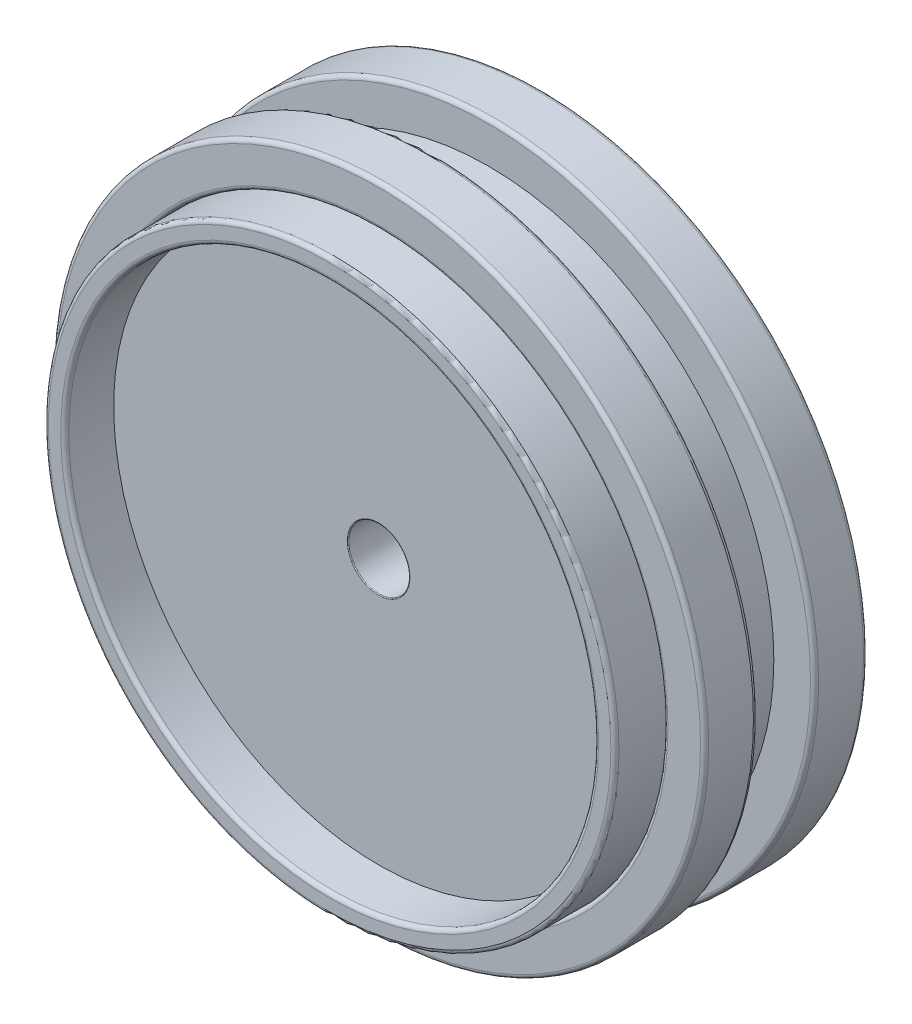
ISO-10303-21;
HEADER;
FILE_DESCRIPTION(('STEP AP214'),'2;1');
FILE_NAME('part.step','',(''),(''),'','','');
FILE_SCHEMA(('AUTOMOTIVE_DESIGN { 1 0 10303 214 1 1 1 1 }'));
ENDSEC;
DATA;
#1=APPLICATION_CONTEXT('core data for automotive mechanical design processes');
#2=APPLICATION_PROTOCOL_DEFINITION('international standard','automotive_design',2000,#1);
#3=PRODUCT_CONTEXT('',#1,'mechanical');
#4=PRODUCT('Part','Part','',(#3));
#5=PRODUCT_RELATED_PRODUCT_CATEGORY('part','',(#4));
#6=PRODUCT_DEFINITION_FORMATION('','',#4);
#7=PRODUCT_DEFINITION_CONTEXT('part definition',#1,'design');
#8=PRODUCT_DEFINITION('design','',#6,#7);
#9=PRODUCT_DEFINITION_SHAPE('','',#8);
#10=(LENGTH_UNIT() NAMED_UNIT(*) SI_UNIT(.MILLI.,.METRE.));
#11=(NAMED_UNIT(*) PLANE_ANGLE_UNIT() SI_UNIT($,.RADIAN.));
#12=(NAMED_UNIT(*) SI_UNIT($,.STERADIAN.) SOLID_ANGLE_UNIT());
#13=UNCERTAINTY_MEASURE_WITH_UNIT(LENGTH_MEASURE(1.E-05),#10,'distance_accuracy_value','');
#14=(GEOMETRIC_REPRESENTATION_CONTEXT(3) GLOBAL_UNCERTAINTY_ASSIGNED_CONTEXT((#13)) GLOBAL_UNIT_ASSIGNED_CONTEXT((#10,
#11,#12)) REPRESENTATION_CONTEXT('',''));
#15=CARTESIAN_POINT('',(0.,0.,0.));
#16=DIRECTION('',(0.,0.,1.));
#17=DIRECTION('',(1.,0.,0.));
#18=AXIS2_PLACEMENT_3D('',#15,#16,#17);
#19=CARTESIAN_POINT('',(0.,0.,-50.8));
#20=DIRECTION('',(0.,0.,1.));
#21=DIRECTION('',(1.,0.,0.));
#22=AXIS2_PLACEMENT_3D('',#19,#20,#21);
#23=CYLINDRICAL_SURFACE('',#22,88.9);
#24=CARTESIAN_POINT('',(0.,0.,-50.8));
#25=DIRECTION('',(0.,0.,1.));
#26=DIRECTION('',(1.,0.,0.));
#27=AXIS2_PLACEMENT_3D('',#24,#25,#26);
#28=CIRCLE('',#27,88.9);
#29=CARTESIAN_POINT('',(88.9,0.,-50.8));
#30=VERTEX_POINT('',#29);
#31=EDGE_CURVE('E71',#30,#30,#28,.T.);
#32=ORIENTED_EDGE('',*,*,#31,.F.);
#33=EDGE_LOOP('',(#32));
#34=FACE_BOUND('',#33,.T.);
#35=CARTESIAN_POINT('',(0.,0.,-34.29));
#36=DIRECTION('',(0.,0.,-1.));
#37=DIRECTION('',(-1.,0.,0.));
#38=AXIS2_PLACEMENT_3D('',#35,#36,#37);
#39=CIRCLE('',#38,88.9);
#40=CARTESIAN_POINT('',(-88.9,0.,-34.29));
#41=VERTEX_POINT('',#40);
#42=EDGE_CURVE('E68',#41,#41,#39,.T.);
#43=ORIENTED_EDGE('',*,*,#42,.F.);
#44=EDGE_LOOP('',(#43));
#45=FACE_BOUND('',#44,.T.);
#46=ADVANCED_FACE('F48',(#34,#45),#23,.F.);
#47=CARTESIAN_POINT('',(0.,0.,-50.8));
#48=DIRECTION('',(0.,0.,1.));
#49=DIRECTION('',(1.,0.,0.));
#50=AXIS2_PLACEMENT_3D('',#47,#48,#49);
#51=CYLINDRICAL_SURFACE('',#50,101.6);
#52=CARTESIAN_POINT('',(0.,0.,-49.53));
#53=DIRECTION('',(0.,0.,1.));
#54=DIRECTION('',(1.,0.,0.));
#55=AXIS2_PLACEMENT_3D('',#52,#53,#54);
#56=CIRCLE('',#55,101.6);
#57=CARTESIAN_POINT('',(101.6,0.,-49.53));
#58=VERTEX_POINT('',#57);
#59=EDGE_CURVE('E59',#58,#58,#56,.T.);
#60=ORIENTED_EDGE('',*,*,#59,.T.);
#61=EDGE_LOOP('',(#60));
#62=FACE_BOUND('',#61,.T.);
#63=CARTESIAN_POINT('',(0.,0.,-35.56));
#64=DIRECTION('',(0.,0.,1.));
#65=DIRECTION('',(1.,0.,0.));
#66=AXIS2_PLACEMENT_3D('',#63,#64,#65);
#67=CIRCLE('',#66,101.6);
#68=CARTESIAN_POINT('',(101.6,0.,-35.56));
#69=VERTEX_POINT('',#68);
#70=EDGE_CURVE('E63',#69,#69,#67,.F.);
#71=ORIENTED_EDGE('',*,*,#70,.T.);
#72=EDGE_LOOP('',(#71));
#73=FACE_BOUND('',#72,.T.);
#74=ADVANCED_FACE('F79',(#62,#73),#51,.T.);
#75=CARTESIAN_POINT('',(0.,0.,-50.8));
#76=DIRECTION('',(0.,0.,1.));
#77=DIRECTION('',(1.,0.,0.));
#78=AXIS2_PLACEMENT_3D('',#75,#76,#77);
#79=PLANE('',#78);
#80=CARTESIAN_POINT('',(0.,0.,-50.8));
#81=DIRECTION('',(0.,0.,1.));
#82=DIRECTION('',(1.,0.,0.));
#83=AXIS2_PLACEMENT_3D('',#80,#81,#82);
#84=CIRCLE('',#83,100.33);
#85=CARTESIAN_POINT('',(100.33,0.,-50.8));
#86=VERTEX_POINT('',#85);
#87=EDGE_CURVE('E55',#86,#86,#84,.F.);
#88=ORIENTED_EDGE('',*,*,#87,.T.);
#89=EDGE_LOOP('',(#88));
#90=FACE_BOUND('',#89,.T.);
#91=ORIENTED_EDGE('',*,*,#31,.T.);
#92=EDGE_LOOP('',(#91));
#93=FACE_BOUND('',#92,.T.);
#94=ADVANCED_FACE('F75',(#90,#93),#79,.F.);
#95=CARTESIAN_POINT('',(101.6,0.,-34.29));
#96=DIRECTION('',(0.,0.,1.));
#97=DIRECTION('',(1.,0.,0.));
#98=AXIS2_PLACEMENT_3D('',#95,#96,#97);
#99=PLANE('',#98);
#100=CARTESIAN_POINT('',(0.,0.,-34.29));
#101=DIRECTION('',(0.,0.,1.));
#102=DIRECTION('',(1.,0.,0.));
#103=AXIS2_PLACEMENT_3D('',#100,#101,#102);
#104=CIRCLE('',#103,100.33);
#105=CARTESIAN_POINT('',(100.33,0.,-34.29));
#106=VERTEX_POINT('',#105);
#107=EDGE_CURVE('E11',#106,#106,#104,.T.);
#108=ORIENTED_EDGE('',*,*,#107,.T.);
#109=EDGE_LOOP('',(#108));
#110=FACE_BOUND('',#109,.T.);
#111=ORIENTED_EDGE('',*,*,#42,.T.);
#112=EDGE_LOOP('',(#111));
#113=FACE_BOUND('',#112,.T.);
#114=ADVANCED_FACE('F83',(#110,#113),#99,.T.);
#115=CARTESIAN_POINT('',(0.,0.,-49.53));
#116=DIRECTION('',(0.,0.,1.));
#117=DIRECTION('',(1.,0.,0.));
#118=AXIS2_PLACEMENT_3D('',#115,#116,#117);
#119=TOROIDAL_SURFACE('',#118,100.33,1.27);
#120=ORIENTED_EDGE('',*,*,#87,.F.);
#121=EDGE_LOOP('',(#120));
#122=FACE_BOUND('',#121,.T.);
#123=ORIENTED_EDGE('',*,*,#59,.F.);
#124=EDGE_LOOP('',(#123));
#125=FACE_BOUND('',#124,.T.);
#126=ADVANCED_FACE('F85',(#122,#125),#119,.T.);
#127=CARTESIAN_POINT('',(0.,0.,-35.56));
#128=DIRECTION('',(0.,0.,1.));
#129=DIRECTION('',(1.,0.,0.));
#130=AXIS2_PLACEMENT_3D('',#127,#128,#129);
#131=TOROIDAL_SURFACE('',#130,100.33,1.27);
#132=ORIENTED_EDGE('',*,*,#107,.F.);
#133=EDGE_LOOP('',(#132));
#134=FACE_BOUND('',#133,.T.);
#135=ORIENTED_EDGE('',*,*,#70,.F.);
#136=EDGE_LOOP('',(#135));
#137=FACE_BOUND('',#136,.T.);
#138=ADVANCED_FACE('F50',(#134,#137),#131,.T.);
#139=CLOSED_SHELL('',(#46,#74,#94,#114,#126,#138));
#140=MANIFOLD_SOLID_BREP('B2',#139);
#141=CARTESIAN_POINT('',(0.,0.,-31.75));
#142=DIRECTION('',(0.,0.,1.));
#143=DIRECTION('',(1.,0.,0.));
#144=AXIS2_PLACEMENT_3D('',#141,#142,#143);
#145=CYLINDRICAL_SURFACE('',#144,82.55);
#146=CARTESIAN_POINT('',(0.,0.,-31.75));
#147=DIRECTION('',(0.,0.,1.));
#148=DIRECTION('',(1.,0.,0.));
#149=AXIS2_PLACEMENT_3D('',#146,#147,#148);
#150=CIRCLE('',#149,82.55);
#151=CARTESIAN_POINT('',(82.55,0.,-31.75));
#152=VERTEX_POINT('',#151);
#153=EDGE_CURVE('E172',#152,#152,#150,.T.);
#154=ORIENTED_EDGE('',*,*,#153,.T.);
#155=EDGE_LOOP('',(#154));
#156=FACE_BOUND('',#155,.T.);
#157=CARTESIAN_POINT('',(0.,0.,0.));
#158=DIRECTION('',(0.,0.,1.));
#159=DIRECTION('',(1.,0.,0.));
#160=AXIS2_PLACEMENT_3D('',#157,#158,#159);
#161=CIRCLE('',#160,82.55);
#162=CARTESIAN_POINT('',(82.55,0.,0.));
#163=VERTEX_POINT('',#162);
#164=EDGE_CURVE('E173',#163,#163,#161,.T.);
#165=ORIENTED_EDGE('',*,*,#164,.F.);
#166=EDGE_LOOP('',(#165));
#167=FACE_BOUND('',#166,.T.);
#168=ADVANCED_FACE('F148',(#156,#167),#145,.T.);
#169=CARTESIAN_POINT('',(0.,0.,-31.75));
#170=DIRECTION('',(0.,0.,1.));
#171=DIRECTION('',(1.,0.,0.));
#172=AXIS2_PLACEMENT_3D('',#169,#170,#171);
#173=PLANE('',#172);
#174=CARTESIAN_POINT('',(0.,0.,-31.75));
#175=DIRECTION('',(0.,0.,1.));
#176=DIRECTION('',(1.,0.,0.));
#177=AXIS2_PLACEMENT_3D('',#174,#175,#176);
#178=CIRCLE('',#177,9.779);
#179=CARTESIAN_POINT('',(9.779,0.,-31.75));
#180=VERTEX_POINT('',#179);
#181=EDGE_CURVE('E166',#180,#180,#178,.T.);
#182=ORIENTED_EDGE('',*,*,#181,.T.);
#183=EDGE_LOOP('',(#182));
#184=FACE_BOUND('',#183,.T.);
#185=ORIENTED_EDGE('',*,*,#153,.F.);
#186=EDGE_LOOP('',(#185));
#187=FACE_BOUND('',#186,.T.);
#188=ADVANCED_FACE('F183',(#184,#187),#173,.F.);
#189=CARTESIAN_POINT('',(0.,0.,0.));
#190=DIRECTION('',(0.,0.,1.));
#191=DIRECTION('',(1.,0.,0.));
#192=AXIS2_PLACEMENT_3D('',#189,#190,#191);
#193=PLANE('',#192);
#194=CARTESIAN_POINT('',(0.,0.,0.));
#195=DIRECTION('',(0.,0.,1.));
#196=DIRECTION('',(1.,0.,0.));
#197=AXIS2_PLACEMENT_3D('',#194,#195,#196);
#198=CIRCLE('',#197,9.779);
#199=CARTESIAN_POINT('',(9.779,0.,0.));
#200=VERTEX_POINT('',#199);
#201=EDGE_CURVE('E47',#200,#200,#198,.F.);
#202=ORIENTED_EDGE('',*,*,#201,.T.);
#203=EDGE_LOOP('',(#202));
#204=FACE_BOUND('',#203,.T.);
#205=ORIENTED_EDGE('',*,*,#164,.T.);
#206=EDGE_LOOP('',(#205));
#207=FACE_BOUND('',#206,.T.);
#208=ADVANCED_FACE('F185',(#204,#207),#193,.T.);
#209=CARTESIAN_POINT('',(0.,0.,-44.45));
#210=DIRECTION('',(0.,0.,1.));
#211=DIRECTION('',(1.,0.,0.));
#212=AXIS2_PLACEMENT_3D('',#209,#210,#211);
#213=CYLINDRICAL_SURFACE('',#212,9.525);
#214=CARTESIAN_POINT('',(0.,0.,-31.496));
#215=DIRECTION('',(0.,0.,1.));
#216=DIRECTION('',(1.,0.,0.));
#217=AXIS2_PLACEMENT_3D('',#214,#215,#216);
#218=CIRCLE('',#217,9.525);
#219=CARTESIAN_POINT('',(9.525,0.,-31.496));
#220=VERTEX_POINT('',#219);
#221=EDGE_CURVE('E156',#220,#220,#218,.F.);
#222=ORIENTED_EDGE('',*,*,#221,.T.);
#223=EDGE_LOOP('',(#222));
#224=FACE_BOUND('',#223,.T.);
#225=CARTESIAN_POINT('',(0.,0.,-0.253999999999997));
#226=DIRECTION('',(0.,0.,1.));
#227=DIRECTION('',(1.,0.,0.));
#228=AXIS2_PLACEMENT_3D('',#225,#226,#227);
#229=CIRCLE('',#228,9.525);
#230=CARTESIAN_POINT('',(9.525,0.,-0.253999999999997));
#231=VERTEX_POINT('',#230);
#232=EDGE_CURVE('E161',#231,#231,#229,.T.);
#233=ORIENTED_EDGE('',*,*,#232,.T.);
#234=EDGE_LOOP('',(#233));
#235=FACE_BOUND('',#234,.T.);
#236=ADVANCED_FACE('F192',(#224,#235),#213,.F.);
#237=CARTESIAN_POINT('',(0.,0.,-31.496));
#238=DIRECTION('',(0.,0.,1.));
#239=DIRECTION('',(1.,0.,0.));
#240=AXIS2_PLACEMENT_3D('',#237,#238,#239);
#241=TOROIDAL_SURFACE('',#240,9.779,0.254);
#242=ORIENTED_EDGE('',*,*,#221,.F.);
#243=EDGE_LOOP('',(#242));
#244=FACE_BOUND('',#243,.T.);
#245=ORIENTED_EDGE('',*,*,#181,.F.);
#246=EDGE_LOOP('',(#245));
#247=FACE_BOUND('',#246,.T.);
#248=ADVANCED_FACE('F196',(#244,#247),#241,.T.);
#249=CARTESIAN_POINT('',(0.,0.,-0.253999999999997));
#250=DIRECTION('',(0.,0.,1.));
#251=DIRECTION('',(1.,0.,0.));
#252=AXIS2_PLACEMENT_3D('',#249,#250,#251);
#253=TOROIDAL_SURFACE('',#252,9.779,0.254);
#254=ORIENTED_EDGE('',*,*,#201,.F.);
#255=EDGE_LOOP('',(#254));
#256=FACE_BOUND('',#255,.T.);
#257=ORIENTED_EDGE('',*,*,#232,.F.);
#258=EDGE_LOOP('',(#257));
#259=FACE_BOUND('',#258,.T.);
#260=ADVANCED_FACE('F150',(#256,#259),#253,.T.);
#261=CLOSED_SHELL('',(#168,#188,#208,#236,#248,#260));
#262=MANIFOLD_SOLID_BREP('B6',#261);
#263=CARTESIAN_POINT('',(0.,0.,-50.8));
#264=DIRECTION('',(0.,0.,1.));
#265=DIRECTION('',(1.,0.,0.));
#266=AXIS2_PLACEMENT_3D('',#263,#264,#265);
#267=CYLINDRICAL_SURFACE('',#266,88.9);
#268=CARTESIAN_POINT('',(0.,0.,-1.27));
#269=DIRECTION('',(0.,0.,1.));
#270=DIRECTION('',(1.,0.,0.));
#271=AXIS2_PLACEMENT_3D('',#268,#269,#270);
#272=CIRCLE('',#271,88.9);
#273=CARTESIAN_POINT('',(88.9,0.,-1.27));
#274=VERTEX_POINT('',#273);
#275=EDGE_CURVE('E276',#274,#274,#272,.T.);
#276=ORIENTED_EDGE('',*,*,#275,.T.);
#277=EDGE_LOOP('',(#276));
#278=FACE_BOUND('',#277,.T.);
#279=CARTESIAN_POINT('',(0.,0.,-16.51));
#280=DIRECTION('',(0.,0.,-1.));
#281=DIRECTION('',(-1.,0.,0.));
#282=AXIS2_PLACEMENT_3D('',#279,#280,#281);
#283=CIRCLE('',#282,88.9);
#284=CARTESIAN_POINT('',(-88.9,0.,-16.51));
#285=VERTEX_POINT('',#284);
#286=EDGE_CURVE('E279',#285,#285,#283,.T.);
#287=ORIENTED_EDGE('',*,*,#286,.T.);
#288=EDGE_LOOP('',(#287));
#289=FACE_BOUND('',#288,.T.);
#290=ADVANCED_FACE('F253',(#278,#289),#267,.F.);
#291=CARTESIAN_POINT('',(0.,0.,0.));
#292=DIRECTION('',(0.,0.,1.));
#293=DIRECTION('',(1.,0.,0.));
#294=AXIS2_PLACEMENT_3D('',#291,#292,#293);
#295=PLANE('',#294);
#296=CARTESIAN_POINT('',(0.,0.,0.));
#297=DIRECTION('',(0.,0.,1.));
#298=DIRECTION('',(1.,0.,0.));
#299=AXIS2_PLACEMENT_3D('',#296,#297,#298);
#300=CIRCLE('',#299,90.17);
#301=CARTESIAN_POINT('',(90.17,0.,0.));
#302=VERTEX_POINT('',#301);
#303=EDGE_CURVE('E268',#302,#302,#300,.F.);
#304=ORIENTED_EDGE('',*,*,#303,.T.);
#305=EDGE_LOOP('',(#304));
#306=FACE_BOUND('',#305,.T.);
#307=CARTESIAN_POINT('',(0.,0.,0.));
#308=DIRECTION('',(0.,0.,1.));
#309=DIRECTION('',(1.,0.,0.));
#310=AXIS2_PLACEMENT_3D('',#307,#308,#309);
#311=CIRCLE('',#310,100.33);
#312=CARTESIAN_POINT('',(100.33,0.,0.));
#313=VERTEX_POINT('',#312);
#314=EDGE_CURVE('E273',#313,#313,#311,.T.);
#315=ORIENTED_EDGE('',*,*,#314,.T.);
#316=EDGE_LOOP('',(#315));
#317=FACE_BOUND('',#316,.T.);
#318=ADVANCED_FACE('F297',(#306,#317),#295,.T.);
#319=CARTESIAN_POINT('',(0.,0.,-50.8));
#320=DIRECTION('',(0.,0.,1.));
#321=DIRECTION('',(1.,0.,0.));
#322=AXIS2_PLACEMENT_3D('',#319,#320,#321);
#323=CYLINDRICAL_SURFACE('',#322,101.6);
#324=CARTESIAN_POINT('',(0.,0.,-15.24));
#325=DIRECTION('',(0.,0.,-1.));
#326=DIRECTION('',(-1.,0.,0.));
#327=AXIS2_PLACEMENT_3D('',#324,#325,#326);
#328=CIRCLE('',#327,101.6);
#329=CARTESIAN_POINT('',(-101.6,0.,-15.24));
#330=VERTEX_POINT('',#329);
#331=EDGE_CURVE('E147',#330,#330,#328,.F.);
#332=ORIENTED_EDGE('',*,*,#331,.T.);
#333=EDGE_LOOP('',(#332));
#334=FACE_BOUND('',#333,.T.);
#335=CARTESIAN_POINT('',(0.,0.,-1.27));
#336=DIRECTION('',(0.,0.,1.));
#337=DIRECTION('',(1.,0.,0.));
#338=AXIS2_PLACEMENT_3D('',#335,#336,#337);
#339=CIRCLE('',#338,101.6);
#340=CARTESIAN_POINT('',(101.6,0.,-1.27));
#341=VERTEX_POINT('',#340);
#342=EDGE_CURVE('E260',#341,#341,#339,.F.);
#343=ORIENTED_EDGE('',*,*,#342,.T.);
#344=EDGE_LOOP('',(#343));
#345=FACE_BOUND('',#344,.T.);
#346=ADVANCED_FACE('F287',(#334,#345),#323,.T.);
#347=CARTESIAN_POINT('',(88.9,0.,-16.51));
#348=DIRECTION('',(0.,0.,-1.));
#349=DIRECTION('',(-1.,0.,0.));
#350=AXIS2_PLACEMENT_3D('',#347,#348,#349);
#351=PLANE('',#350);
#352=CARTESIAN_POINT('',(0.,0.,-16.51));
#353=DIRECTION('',(0.,0.,-1.));
#354=DIRECTION('',(-1.,0.,0.));
#355=AXIS2_PLACEMENT_3D('',#352,#353,#354);
#356=CIRCLE('',#355,100.33);
#357=CARTESIAN_POINT('',(-100.33,0.,-16.51));
#358=VERTEX_POINT('',#357);
#359=EDGE_CURVE('E264',#358,#358,#356,.T.);
#360=ORIENTED_EDGE('',*,*,#359,.T.);
#361=EDGE_LOOP('',(#360));
#362=FACE_BOUND('',#361,.T.);
#363=ORIENTED_EDGE('',*,*,#286,.F.);
#364=EDGE_LOOP('',(#363));
#365=FACE_BOUND('',#364,.T.);
#366=ADVANCED_FACE('F284',(#362,#365),#351,.T.);
#367=CARTESIAN_POINT('',(0.,0.,-1.27));
#368=DIRECTION('',(0.,0.,1.));
#369=DIRECTION('',(1.,0.,0.));
#370=AXIS2_PLACEMENT_3D('',#367,#368,#369);
#371=TOROIDAL_SURFACE('',#370,90.17,1.27);
#372=ORIENTED_EDGE('',*,*,#303,.F.);
#373=EDGE_LOOP('',(#372));
#374=FACE_BOUND('',#373,.T.);
#375=ORIENTED_EDGE('',*,*,#275,.F.);
#376=EDGE_LOOP('',(#375));
#377=FACE_BOUND('',#376,.T.);
#378=ADVANCED_FACE('F286',(#374,#377),#371,.T.);
#379=CARTESIAN_POINT('',(0.,0.,-15.24));
#380=DIRECTION('',(0.,0.,-1.));
#381=DIRECTION('',(-1.,0.,0.));
#382=AXIS2_PLACEMENT_3D('',#379,#380,#381);
#383=TOROIDAL_SURFACE('',#382,100.33,1.27);
#384=ORIENTED_EDGE('',*,*,#331,.F.);
#385=EDGE_LOOP('',(#384));
#386=FACE_BOUND('',#385,.T.);
#387=ORIENTED_EDGE('',*,*,#359,.F.);
#388=EDGE_LOOP('',(#387));
#389=FACE_BOUND('',#388,.T.);
#390=ADVANCED_FACE('F294',(#386,#389),#383,.T.);
#391=CARTESIAN_POINT('',(0.,0.,-1.27));
#392=DIRECTION('',(0.,0.,1.));
#393=DIRECTION('',(1.,0.,0.));
#394=AXIS2_PLACEMENT_3D('',#391,#392,#393);
#395=TOROIDAL_SURFACE('',#394,100.33,1.27);
#396=ORIENTED_EDGE('',*,*,#342,.F.);
#397=EDGE_LOOP('',(#396));
#398=FACE_BOUND('',#397,.T.);
#399=ORIENTED_EDGE('',*,*,#314,.F.);
#400=EDGE_LOOP('',(#399));
#401=FACE_BOUND('',#400,.T.);
#402=ADVANCED_FACE('F255',(#398,#401),#395,.T.);
#403=CLOSED_SHELL('',(#290,#318,#346,#366,#378,#390,#402));
#404=MANIFOLD_SOLID_BREP('B42',#403);
#405=CARTESIAN_POINT('',(0.,0.,-50.8));
#406=DIRECTION('',(0.,0.,1.));
#407=DIRECTION('',(1.,0.,0.));
#408=AXIS2_PLACEMENT_3D('',#405,#406,#407);
#409=CYLINDRICAL_SURFACE('',#408,82.55);
#410=CARTESIAN_POINT('',(0.,0.,-49.53));
#411=DIRECTION('',(0.,0.,1.));
#412=DIRECTION('',(1.,0.,0.));
#413=AXIS2_PLACEMENT_3D('',#410,#411,#412);
#414=CIRCLE('',#413,82.55);
#415=CARTESIAN_POINT('',(82.55,0.,-49.53));
#416=VERTEX_POINT('',#415);
#417=EDGE_CURVE('E375',#416,#416,#414,.F.);
#418=ORIENTED_EDGE('',*,*,#417,.T.);
#419=EDGE_LOOP('',(#418));
#420=FACE_BOUND('',#419,.T.);
#421=CARTESIAN_POINT('',(0.,0.,13.97));
#422=DIRECTION('',(0.,0.,1.));
#423=DIRECTION('',(1.,0.,0.));
#424=AXIS2_PLACEMENT_3D('',#421,#422,#423);
#425=CIRCLE('',#424,82.55);
#426=CARTESIAN_POINT('',(82.55,0.,13.97));
#427=VERTEX_POINT('',#426);
#428=EDGE_CURVE('E380',#427,#427,#425,.T.);
#429=ORIENTED_EDGE('',*,*,#428,.T.);
#430=EDGE_LOOP('',(#429));
#431=FACE_BOUND('',#430,.T.);
#432=ADVANCED_FACE('F360',(#420,#431),#409,.F.);
#433=CARTESIAN_POINT('',(0.,0.,-50.8));
#434=DIRECTION('',(0.,0.,1.));
#435=DIRECTION('',(1.,0.,0.));
#436=AXIS2_PLACEMENT_3D('',#433,#434,#435);
#437=CYLINDRICAL_SURFACE('',#436,88.9);
#438=CARTESIAN_POINT('',(0.,0.,13.97));
#439=DIRECTION('',(0.,0.,1.));
#440=DIRECTION('',(1.,0.,0.));
#441=AXIS2_PLACEMENT_3D('',#438,#439,#440);
#442=CIRCLE('',#441,88.9);
#443=CARTESIAN_POINT('',(88.9,0.,13.97));
#444=VERTEX_POINT('',#443);
#445=EDGE_CURVE('E252',#444,#444,#442,.F.);
#446=ORIENTED_EDGE('',*,*,#445,.T.);
#447=EDGE_LOOP('',(#446));
#448=FACE_BOUND('',#447,.T.);
#449=CARTESIAN_POINT('',(0.,0.,-50.8));
#450=DIRECTION('',(0.,0.,1.));
#451=DIRECTION('',(1.,0.,0.));
#452=AXIS2_PLACEMENT_3D('',#449,#450,#451);
#453=CIRCLE('',#452,88.9);
#454=CARTESIAN_POINT('',(88.9,0.,-50.8));
#455=VERTEX_POINT('',#454);
#456=EDGE_CURVE('E386',#455,#455,#453,.T.);
#457=ORIENTED_EDGE('',*,*,#456,.T.);
#458=EDGE_LOOP('',(#457));
#459=FACE_BOUND('',#458,.T.);
#460=ADVANCED_FACE('F390',(#448,#459),#437,.T.);
#461=CARTESIAN_POINT('',(0.,0.,-50.8));
#462=DIRECTION('',(0.,0.,1.));
#463=DIRECTION('',(1.,0.,0.));
#464=AXIS2_PLACEMENT_3D('',#461,#462,#463);
#465=PLANE('',#464);
#466=CARTESIAN_POINT('',(0.,0.,-50.8));
#467=DIRECTION('',(0.,0.,1.));
#468=DIRECTION('',(1.,0.,0.));
#469=AXIS2_PLACEMENT_3D('',#466,#467,#468);
#470=CIRCLE('',#469,83.82);
#471=CARTESIAN_POINT('',(83.82,0.,-50.8));
#472=VERTEX_POINT('',#471);
#473=EDGE_CURVE('E383',#472,#472,#470,.T.);
#474=ORIENTED_EDGE('',*,*,#473,.T.);
#475=EDGE_LOOP('',(#474));
#476=FACE_BOUND('',#475,.T.);
#477=ORIENTED_EDGE('',*,*,#456,.F.);
#478=EDGE_LOOP('',(#477));
#479=FACE_BOUND('',#478,.T.);
#480=ADVANCED_FACE('F392',(#476,#479),#465,.F.);
#481=CARTESIAN_POINT('',(0.,0.,15.24));
#482=DIRECTION('',(0.,0.,1.));
#483=DIRECTION('',(1.,0.,0.));
#484=AXIS2_PLACEMENT_3D('',#481,#482,#483);
#485=PLANE('',#484);
#486=CARTESIAN_POINT('',(0.,0.,15.24));
#487=DIRECTION('',(0.,0.,1.));
#488=DIRECTION('',(1.,0.,0.));
#489=AXIS2_PLACEMENT_3D('',#486,#487,#488);
#490=CIRCLE('',#489,83.82);
#491=CARTESIAN_POINT('',(83.82,0.,15.24));
#492=VERTEX_POINT('',#491);
#493=EDGE_CURVE('E367',#492,#492,#490,.F.);
#494=ORIENTED_EDGE('',*,*,#493,.T.);
#495=EDGE_LOOP('',(#494));
#496=FACE_BOUND('',#495,.T.);
#497=CARTESIAN_POINT('',(0.,0.,15.24));
#498=DIRECTION('',(0.,0.,1.));
#499=DIRECTION('',(1.,0.,0.));
#500=AXIS2_PLACEMENT_3D('',#497,#498,#499);
#501=CIRCLE('',#500,87.63);
#502=CARTESIAN_POINT('',(87.63,0.,15.24));
#503=VERTEX_POINT('',#502);
#504=EDGE_CURVE('E371',#503,#503,#501,.T.);
#505=ORIENTED_EDGE('',*,*,#504,.T.);
#506=EDGE_LOOP('',(#505));
#507=FACE_BOUND('',#506,.T.);
#508=ADVANCED_FACE('F394',(#496,#507),#485,.T.);
#509=CARTESIAN_POINT('',(0.,0.,-49.53));
#510=DIRECTION('',(0.,0.,1.));
#511=DIRECTION('',(1.,0.,0.));
#512=AXIS2_PLACEMENT_3D('',#509,#510,#511);
#513=TOROIDAL_SURFACE('',#512,83.82,1.27);
#514=ORIENTED_EDGE('',*,*,#417,.F.);
#515=EDGE_LOOP('',(#514));
#516=FACE_BOUND('',#515,.T.);
#517=ORIENTED_EDGE('',*,*,#473,.F.);
#518=EDGE_LOOP('',(#517));
#519=FACE_BOUND('',#518,.T.);
#520=ADVANCED_FACE('F401',(#516,#519),#513,.T.);
#521=CARTESIAN_POINT('',(0.,0.,13.97));
#522=DIRECTION('',(0.,0.,1.));
#523=DIRECTION('',(1.,0.,0.));
#524=AXIS2_PLACEMENT_3D('',#521,#522,#523);
#525=TOROIDAL_SURFACE('',#524,83.82,1.27);
#526=ORIENTED_EDGE('',*,*,#493,.F.);
#527=EDGE_LOOP('',(#526));
#528=FACE_BOUND('',#527,.T.);
#529=ORIENTED_EDGE('',*,*,#428,.F.);
#530=EDGE_LOOP('',(#529));
#531=FACE_BOUND('',#530,.T.);
#532=ADVANCED_FACE('F412',(#528,#531),#525,.T.);
#533=CARTESIAN_POINT('',(0.,0.,13.97));
#534=DIRECTION('',(0.,0.,1.));
#535=DIRECTION('',(1.,0.,0.));
#536=AXIS2_PLACEMENT_3D('',#533,#534,#535);
#537=TOROIDAL_SURFACE('',#536,87.63,1.27);
#538=ORIENTED_EDGE('',*,*,#445,.F.);
#539=EDGE_LOOP('',(#538));
#540=FACE_BOUND('',#539,.T.);
#541=ORIENTED_EDGE('',*,*,#504,.F.);
#542=EDGE_LOOP('',(#541));
#543=FACE_BOUND('',#542,.T.);
#544=ADVANCED_FACE('F362',(#540,#543),#537,.T.);
#545=CLOSED_SHELL('',(#432,#460,#480,#508,#520,#532,#544));
#546=MANIFOLD_SOLID_BREP('B142',#545);
#547=ADVANCED_BREP_SHAPE_REPRESENTATION('',(#18,#140,#262,#404,#546),#14);
#548=SHAPE_DEFINITION_REPRESENTATION(#9,#547);
ENDSEC;
END-ISO-10303-21;
